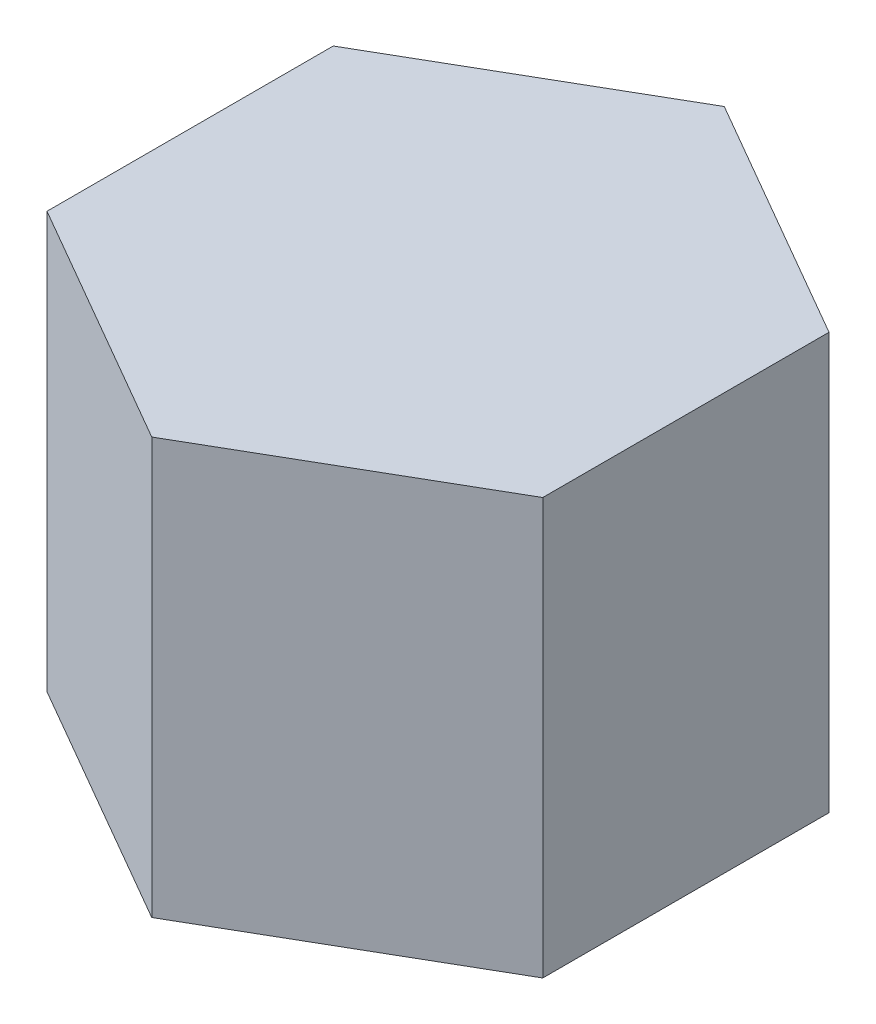
ISO-10303-21;
HEADER;
FILE_DESCRIPTION(('STEP AP214'),'2;1');
FILE_NAME('part.step','',(''),(''),'','','');
FILE_SCHEMA(('AUTOMOTIVE_DESIGN { 1 0 10303 214 1 1 1 1 }'));
ENDSEC;
DATA;
#1=APPLICATION_CONTEXT('core data for automotive mechanical design processes');
#2=APPLICATION_PROTOCOL_DEFINITION('international standard','automotive_design',2000,#1);
#3=PRODUCT_CONTEXT('',#1,'mechanical');
#4=PRODUCT('Part','Part','',(#3));
#5=PRODUCT_RELATED_PRODUCT_CATEGORY('part','',(#4));
#6=PRODUCT_DEFINITION_FORMATION('','',#4);
#7=PRODUCT_DEFINITION_CONTEXT('part definition',#1,'design');
#8=PRODUCT_DEFINITION('design','',#6,#7);
#9=PRODUCT_DEFINITION_SHAPE('','',#8);
#10=(LENGTH_UNIT() NAMED_UNIT(*) SI_UNIT(.MILLI.,.METRE.));
#11=(NAMED_UNIT(*) PLANE_ANGLE_UNIT() SI_UNIT($,.RADIAN.));
#12=(NAMED_UNIT(*) SI_UNIT($,.STERADIAN.) SOLID_ANGLE_UNIT());
#13=UNCERTAINTY_MEASURE_WITH_UNIT(LENGTH_MEASURE(1.E-05),#10,'distance_accuracy_value','');
#14=(GEOMETRIC_REPRESENTATION_CONTEXT(3) GLOBAL_UNCERTAINTY_ASSIGNED_CONTEXT((#13)) GLOBAL_UNIT_ASSIGNED_CONTEXT((#10,
#11,#12)) REPRESENTATION_CONTEXT('',''));
#15=CARTESIAN_POINT('',(0.,0.,0.));
#16=DIRECTION('',(0.,0.,1.));
#17=DIRECTION('',(1.,0.,0.));
#18=AXIS2_PLACEMENT_3D('',#15,#16,#17);
#19=CARTESIAN_POINT('',(203.839551417382,-147.556598747966,296.012098239417));
#20=DIRECTION('',(-0.500000000000096,0.,-0.866025403784383));
#21=DIRECTION('',(-0.866025403784383,0.,0.500000000000096));
#22=AXIS2_PLACEMENT_3D('',#19,#20,#21);
#23=PLANE('',#22);
#24=CARTESIAN_POINT('',(204.142660308706,-147.047793579175,295.837098239417));
#25=DIRECTION('',(-0.866025403784383,0.,0.500000000000096));
#26=VECTOR('',#25,1.);
#27=LINE('',#24,#26);
#28=CARTESIAN_POINT('',(204.142660308706,-147.047793579175,295.837098239417));
#29=VERTEX_POINT('',#28);
#30=CARTESIAN_POINT('',(203.839551417382,-147.047793579175,296.012098239417));
#31=VERTEX_POINT('',#30);
#32=EDGE_CURVE('E170',#29,#31,#27,.T.);
#33=ORIENTED_EDGE('',*,*,#32,.T.);
#34=CARTESIAN_POINT('',(203.839551417382,-147.556598747966,296.012098239417));
#35=DIRECTION('',(0.,1.,0.));
#36=VECTOR('',#35,1.);
#37=LINE('',#34,#36);
#38=CARTESIAN_POINT('',(203.839551417382,-147.556598747966,296.012098239417));
#39=VERTEX_POINT('',#38);
#40=EDGE_CURVE('E35',#39,#31,#37,.T.);
#41=ORIENTED_EDGE('',*,*,#40,.F.);
#42=CARTESIAN_POINT('',(204.142660308706,-147.556598747966,295.837098239417));
#43=DIRECTION('',(-0.866025403784383,0.,0.500000000000096));
#44=VECTOR('',#43,1.);
#45=LINE('',#42,#44);
#46=CARTESIAN_POINT('',(204.142660308706,-147.556598747966,295.837098239417));
#47=VERTEX_POINT('',#46);
#48=EDGE_CURVE('E159',#47,#39,#45,.T.);
#49=ORIENTED_EDGE('',*,*,#48,.F.);
#50=CARTESIAN_POINT('',(204.142660308706,-147.556598747966,295.837098239417));
#51=DIRECTION('',(0.,1.,0.));
#52=VECTOR('',#51,1.);
#53=LINE('',#50,#52);
#54=EDGE_CURVE('E10',#47,#29,#53,.T.);
#55=ORIENTED_EDGE('',*,*,#54,.T.);
#56=EDGE_LOOP('',(#33,#41,#49,#55));
#57=FACE_BOUND('',#56,.T.);
#58=ADVANCED_FACE('F16',(#57),#23,.F.);
#59=CARTESIAN_POINT('',(204.142660308706,-147.556598747966,291.594471220494));
#60=DIRECTION('',(-1.,0.,0.));
#61=DIRECTION('',(0.,-1.,0.));
#62=AXIS2_PLACEMENT_3D('',#59,#60,#61);
#63=PLANE('',#62);
#64=CARTESIAN_POINT('',(204.142660308706,-147.047793579175,295.487098239417));
#65=DIRECTION('',(0.,0.,1.));
#66=VECTOR('',#65,1.);
#67=LINE('',#64,#66);
#68=CARTESIAN_POINT('',(204.142660308706,-147.047793579175,295.487098239417));
#69=VERTEX_POINT('',#68);
#70=EDGE_CURVE('E167',#69,#29,#67,.T.);
#71=ORIENTED_EDGE('',*,*,#70,.T.);
#72=ORIENTED_EDGE('',*,*,#54,.F.);
#73=CARTESIAN_POINT('',(204.142660308706,-147.556598747966,295.487098239417));
#74=DIRECTION('',(0.,0.,1.));
#75=VECTOR('',#74,1.);
#76=LINE('',#73,#75);
#77=CARTESIAN_POINT('',(204.142660308706,-147.556598747966,295.487098239417));
#78=VERTEX_POINT('',#77);
#79=EDGE_CURVE('E156',#78,#47,#76,.T.);
#80=ORIENTED_EDGE('',*,*,#79,.F.);
#81=CARTESIAN_POINT('',(204.142660308706,-147.556598747966,295.487098239417));
#82=DIRECTION('',(0.,1.,0.));
#83=VECTOR('',#82,1.);
#84=LINE('',#81,#83);
#85=EDGE_CURVE('E27',#78,#69,#84,.T.);
#86=ORIENTED_EDGE('',*,*,#85,.T.);
#87=EDGE_LOOP('',(#71,#72,#80,#86));
#88=FACE_BOUND('',#87,.T.);
#89=ADVANCED_FACE('F189',(#88),#63,.F.);
#90=CARTESIAN_POINT('',(204.142660308706,-147.556598747966,295.487098239417));
#91=DIRECTION('',(-0.500000000000062,0.,0.866025403784403));
#92=DIRECTION('',(0.866025403784403,0.,0.500000000000062));
#93=AXIS2_PLACEMENT_3D('',#90,#91,#92);
#94=PLANE('',#93);
#95=CARTESIAN_POINT('',(203.839551417382,-147.047793579175,295.312098239417));
#96=DIRECTION('',(0.866025403784403,0.,0.500000000000062));
#97=VECTOR('',#96,1.);
#98=LINE('',#95,#97);
#99=CARTESIAN_POINT('',(203.839551417382,-147.047793579175,295.312098239417));
#100=VERTEX_POINT('',#99);
#101=EDGE_CURVE('E163',#100,#69,#98,.T.);
#102=ORIENTED_EDGE('',*,*,#101,.T.);
#103=ORIENTED_EDGE('',*,*,#85,.F.);
#104=CARTESIAN_POINT('',(203.839551417382,-147.556598747966,295.312098239417));
#105=DIRECTION('',(0.866025403784403,0.,0.500000000000062));
#106=VECTOR('',#105,1.);
#107=LINE('',#104,#106);
#108=CARTESIAN_POINT('',(203.839551417382,-147.556598747966,295.312098239417));
#109=VERTEX_POINT('',#108);
#110=EDGE_CURVE('E106',#109,#78,#107,.T.);
#111=ORIENTED_EDGE('',*,*,#110,.F.);
#112=CARTESIAN_POINT('',(203.839551417382,-147.556598747966,295.312098239417));
#113=DIRECTION('',(0.,1.,0.));
#114=VECTOR('',#113,1.);
#115=LINE('',#112,#114);
#116=EDGE_CURVE('E94',#109,#100,#115,.T.);
#117=ORIENTED_EDGE('',*,*,#116,.T.);
#118=EDGE_LOOP('',(#102,#103,#111,#117));
#119=FACE_BOUND('',#118,.T.);
#120=ADVANCED_FACE('F198',(#119),#94,.F.);
#121=CARTESIAN_POINT('',(203.839551417382,-147.556598747966,295.312098239417));
#122=DIRECTION('',(0.500000000000096,0.,0.866025403784383));
#123=DIRECTION('',(0.866025403784383,0.,-0.500000000000096));
#124=AXIS2_PLACEMENT_3D('',#121,#122,#123);
#125=PLANE('',#124);
#126=CARTESIAN_POINT('',(203.536442526057,-147.047793579175,295.487098239417));
#127=DIRECTION('',(0.866025403784383,0.,-0.500000000000096));
#128=VECTOR('',#127,1.);
#129=LINE('',#126,#128);
#130=CARTESIAN_POINT('',(203.536442526057,-147.047793579175,295.487098239417));
#131=VERTEX_POINT('',#130);
#132=EDGE_CURVE('E162',#131,#100,#129,.T.);
#133=ORIENTED_EDGE('',*,*,#132,.T.);
#134=ORIENTED_EDGE('',*,*,#116,.F.);
#135=CARTESIAN_POINT('',(203.536442526057,-147.556598747966,295.487098239417));
#136=DIRECTION('',(0.866025403784383,0.,-0.500000000000096));
#137=VECTOR('',#136,1.);
#138=LINE('',#135,#137);
#139=CARTESIAN_POINT('',(203.536442526057,-147.556598747966,295.487098239417));
#140=VERTEX_POINT('',#139);
#141=EDGE_CURVE('E98',#140,#109,#138,.T.);
#142=ORIENTED_EDGE('',*,*,#141,.F.);
#143=CARTESIAN_POINT('',(203.536442526057,-147.556598747966,295.487098239417));
#144=DIRECTION('',(0.,1.,0.));
#145=VECTOR('',#144,1.);
#146=LINE('',#143,#145);
#147=EDGE_CURVE('E79',#140,#131,#146,.T.);
#148=ORIENTED_EDGE('',*,*,#147,.T.);
#149=EDGE_LOOP('',(#133,#134,#142,#148));
#150=FACE_BOUND('',#149,.T.);
#151=ADVANCED_FACE('F100',(#150),#125,.F.);
#152=CARTESIAN_POINT('',(203.536442526057,-147.556598747966,291.594471220494));
#153=DIRECTION('',(1.,0.,0.));
#154=DIRECTION('',(0.,1.,0.));
#155=AXIS2_PLACEMENT_3D('',#152,#153,#154);
#156=PLANE('',#155);
#157=CARTESIAN_POINT('',(203.536442526057,-147.047793579175,295.837098239417));
#158=DIRECTION('',(0.,0.,-1.));
#159=VECTOR('',#158,1.);
#160=LINE('',#157,#159);
#161=CARTESIAN_POINT('',(203.536442526057,-147.047793579175,295.837098239417));
#162=VERTEX_POINT('',#161);
#163=EDGE_CURVE('E88',#162,#131,#160,.T.);
#164=ORIENTED_EDGE('',*,*,#163,.T.);
#165=ORIENTED_EDGE('',*,*,#147,.F.);
#166=CARTESIAN_POINT('',(203.536442526057,-147.556598747966,295.837098239417));
#167=DIRECTION('',(0.,0.,-1.));
#168=VECTOR('',#167,1.);
#169=LINE('',#166,#168);
#170=CARTESIAN_POINT('',(203.536442526057,-147.556598747966,295.837098239417));
#171=VERTEX_POINT('',#170);
#172=EDGE_CURVE('E84',#171,#140,#169,.T.);
#173=ORIENTED_EDGE('',*,*,#172,.F.);
#174=CARTESIAN_POINT('',(203.536442526057,-147.556598747966,295.837098239417));
#175=DIRECTION('',(0.,1.,0.));
#176=VECTOR('',#175,1.);
#177=LINE('',#174,#176);
#178=EDGE_CURVE('E58',#171,#162,#177,.T.);
#179=ORIENTED_EDGE('',*,*,#178,.T.);
#180=EDGE_LOOP('',(#164,#165,#173,#179));
#181=FACE_BOUND('',#180,.T.);
#182=ADVANCED_FACE('F82',(#181),#156,.F.);
#183=CARTESIAN_POINT('',(203.536442526057,-147.556598747966,295.837098239417));
#184=DIRECTION('',(0.499999999999978,0.,-0.866025403784452));
#185=DIRECTION('',(-0.866025403784452,0.,-0.499999999999978));
#186=AXIS2_PLACEMENT_3D('',#183,#184,#185);
#187=PLANE('',#186);
#188=CARTESIAN_POINT('',(203.839551417382,-147.047793579175,296.012098239417));
#189=DIRECTION('',(-0.866025403784452,0.,-0.499999999999978));
#190=VECTOR('',#189,1.);
#191=LINE('',#188,#190);
#192=EDGE_CURVE('E160',#31,#162,#191,.T.);
#193=ORIENTED_EDGE('',*,*,#192,.T.);
#194=ORIENTED_EDGE('',*,*,#178,.F.);
#195=CARTESIAN_POINT('',(203.839551417382,-147.556598747966,296.012098239417));
#196=DIRECTION('',(-0.866025403784452,0.,-0.499999999999978));
#197=VECTOR('',#196,1.);
#198=LINE('',#195,#197);
#199=EDGE_CURVE('E112',#39,#171,#198,.T.);
#200=ORIENTED_EDGE('',*,*,#199,.F.);
#201=ORIENTED_EDGE('',*,*,#40,.T.);
#202=EDGE_LOOP('',(#193,#194,#200,#201));
#203=FACE_BOUND('',#202,.T.);
#204=ADVANCED_FACE('F131',(#203),#187,.F.);
#205=CARTESIAN_POINT('',(206.491105863044,-147.556598747966,291.594471220494));
#206=DIRECTION('',(0.,1.,0.));
#207=DIRECTION('',(-1.,0.,0.));
#208=AXIS2_PLACEMENT_3D('',#205,#206,#207);
#209=PLANE('',#208);
#210=ORIENTED_EDGE('',*,*,#48,.T.);
#211=ORIENTED_EDGE('',*,*,#199,.T.);
#212=ORIENTED_EDGE('',*,*,#172,.T.);
#213=ORIENTED_EDGE('',*,*,#141,.T.);
#214=ORIENTED_EDGE('',*,*,#110,.T.);
#215=ORIENTED_EDGE('',*,*,#79,.T.);
#216=EDGE_LOOP('',(#210,#211,#212,#213,#214,#215));
#217=FACE_BOUND('',#216,.T.);
#218=ADVANCED_FACE('F111',(#217),#209,.F.);
#219=CARTESIAN_POINT('',(206.491105863044,-147.047793579175,291.594471220494));
#220=DIRECTION('',(0.,1.,0.));
#221=DIRECTION('',(-1.,0.,0.));
#222=AXIS2_PLACEMENT_3D('',#219,#220,#221);
#223=PLANE('',#222);
#224=ORIENTED_EDGE('',*,*,#32,.F.);
#225=ORIENTED_EDGE('',*,*,#70,.F.);
#226=ORIENTED_EDGE('',*,*,#101,.F.);
#227=ORIENTED_EDGE('',*,*,#132,.F.);
#228=ORIENTED_EDGE('',*,*,#163,.F.);
#229=ORIENTED_EDGE('',*,*,#192,.F.);
#230=EDGE_LOOP('',(#224,#225,#226,#227,#228,#229));
#231=FACE_BOUND('',#230,.T.);
#232=ADVANCED_FACE('F130',(#231),#223,.T.);
#233=CLOSED_SHELL('',(#58,#89,#120,#151,#182,#204,#218,#232));
#234=MANIFOLD_SOLID_BREP('B1',#233);
#235=ADVANCED_BREP_SHAPE_REPRESENTATION('',(#18,#234),#14);
#236=SHAPE_DEFINITION_REPRESENTATION(#9,#235);
ENDSEC;
END-ISO-10303-21;
